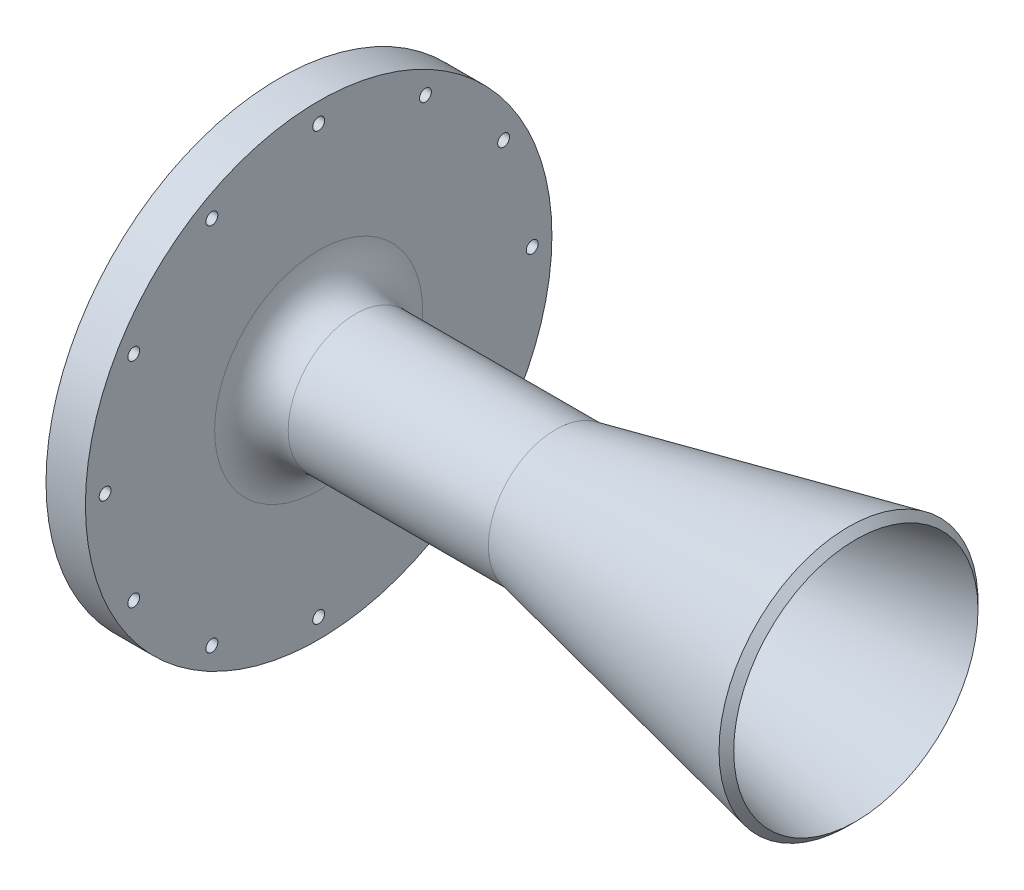
ISO-10303-21;
HEADER;
FILE_DESCRIPTION(('STEP AP214'),'2;1');
FILE_NAME('part.step','',(''),(''),'','','');
FILE_SCHEMA(('AUTOMOTIVE_DESIGN { 1 0 10303 214 1 1 1 1 }'));
ENDSEC;
DATA;
#1=APPLICATION_CONTEXT('core data for automotive mechanical design processes');
#2=APPLICATION_PROTOCOL_DEFINITION('international standard','automotive_design',2000,#1);
#3=PRODUCT_CONTEXT('',#1,'mechanical');
#4=PRODUCT('Part','Part','',(#3));
#5=PRODUCT_RELATED_PRODUCT_CATEGORY('part','',(#4));
#6=PRODUCT_DEFINITION_FORMATION('','',#4);
#7=PRODUCT_DEFINITION_CONTEXT('part definition',#1,'design');
#8=PRODUCT_DEFINITION('design','',#6,#7);
#9=PRODUCT_DEFINITION_SHAPE('','',#8);
#10=(LENGTH_UNIT() NAMED_UNIT(*) SI_UNIT(.MILLI.,.METRE.));
#11=(NAMED_UNIT(*) PLANE_ANGLE_UNIT() SI_UNIT($,.RADIAN.));
#12=(NAMED_UNIT(*) SI_UNIT($,.STERADIAN.) SOLID_ANGLE_UNIT());
#13=UNCERTAINTY_MEASURE_WITH_UNIT(LENGTH_MEASURE(1.E-05),#10,'distance_accuracy_value','');
#14=(GEOMETRIC_REPRESENTATION_CONTEXT(3) GLOBAL_UNCERTAINTY_ASSIGNED_CONTEXT((#13)) GLOBAL_UNIT_ASSIGNED_CONTEXT((#10,
#11,#12)) REPRESENTATION_CONTEXT('',''));
#15=CARTESIAN_POINT('',(0.,0.,0.));
#16=DIRECTION('',(0.,0.,1.));
#17=DIRECTION('',(1.,0.,0.));
#18=AXIS2_PLACEMENT_3D('',#15,#16,#17);
#19=CARTESIAN_POINT('',(0.,20.583496155902,0.));
#20=DIRECTION('',(1.,0.,0.));
#21=DIRECTION('',(0.,0.,-1.));
#22=AXIS2_PLACEMENT_3D('',#19,#20,#21);
#23=PLANE('',#22);
#24=CARTESIAN_POINT('',(0.,0.,0.));
#25=DIRECTION('',(1.,0.,0.));
#26=DIRECTION('',(0.,0.,-1.));
#27=AXIS2_PLACEMENT_3D('',#24,#25,#26);
#28=CIRCLE('',#27,38.1);
#29=CARTESIAN_POINT('',(0.,0.,-38.1));
#30=VERTEX_POINT('',#29);
#31=EDGE_CURVE('E168',#30,#30,#28,.T.);
#32=ORIENTED_EDGE('',*,*,#31,.T.);
#33=EDGE_LOOP('',(#32));
#34=FACE_BOUND('',#33,.T.);
#35=CARTESIAN_POINT('',(0.,-13.3616626129386,49.8664037450867));
#36=DIRECTION('',(-1.,0.,0.));
#37=DIRECTION('',(0.,0.,1.));
#38=AXIS2_PLACEMENT_3D('',#35,#36,#37);
#39=CIRCLE('',#38,2.38125);
#40=CARTESIAN_POINT('',(0.,-13.3616626129386,52.2476537450867));
#41=VERTEX_POINT('',#40);
#42=EDGE_CURVE('E59',#41,#41,#39,.T.);
#43=ORIENTED_EDGE('',*,*,#42,.F.);
#44=EDGE_LOOP('',(#43));
#45=FACE_BOUND('',#44,.T.);
#46=CARTESIAN_POINT('',(0.,13.3616626129382,-49.8664037450868));
#47=DIRECTION('',(-1.,0.,0.));
#48=DIRECTION('',(0.,0.,1.));
#49=AXIS2_PLACEMENT_3D('',#46,#47,#48);
#50=CIRCLE('',#49,2.38125);
#51=CARTESIAN_POINT('',(0.,13.3616626129382,-47.4851537450868));
#52=VERTEX_POINT('',#51);
#53=EDGE_CURVE('E58',#52,#52,#50,.T.);
#54=ORIENTED_EDGE('',*,*,#53,.F.);
#55=EDGE_LOOP('',(#54));
#56=FACE_BOUND('',#55,.T.);
#57=CARTESIAN_POINT('',(0.,-44.7089944830735,-25.81275));
#58=DIRECTION('',(-1.,0.,0.));
#59=DIRECTION('',(0.,0.,1.));
#60=AXIS2_PLACEMENT_3D('',#57,#58,#59);
#61=CIRCLE('',#60,1.43509999999999);
#62=CARTESIAN_POINT('',(0.,-44.7089944830735,-24.37765));
#63=VERTEX_POINT('',#62);
#64=EDGE_CURVE('E77',#63,#63,#61,.T.);
#65=ORIENTED_EDGE('',*,*,#64,.F.);
#66=EDGE_LOOP('',(#65));
#67=FACE_BOUND('',#66,.T.);
#68=CARTESIAN_POINT('',(0.,-25.81275,-44.7089944830735));
#69=DIRECTION('',(-1.,0.,0.));
#70=DIRECTION('',(0.,0.,1.));
#71=AXIS2_PLACEMENT_3D('',#68,#69,#70);
#72=CIRCLE('',#71,1.43509999999999);
#73=CARTESIAN_POINT('',(0.,-25.81275,-43.2738944830735));
#74=VERTEX_POINT('',#73);
#75=EDGE_CURVE('E83',#74,#74,#72,.T.);
#76=ORIENTED_EDGE('',*,*,#75,.F.);
#77=EDGE_LOOP('',(#76));
#78=FACE_BOUND('',#77,.T.);
#79=CARTESIAN_POINT('',(0.,0.,-51.6255));
#80=DIRECTION('',(-1.,0.,0.));
#81=DIRECTION('',(0.,0.,1.));
#82=AXIS2_PLACEMENT_3D('',#79,#80,#81);
#83=CIRCLE('',#82,1.43509999999999);
#84=CARTESIAN_POINT('',(0.,0.,-50.1904));
#85=VERTEX_POINT('',#84);
#86=EDGE_CURVE('E89',#85,#85,#83,.T.);
#87=ORIENTED_EDGE('',*,*,#86,.F.);
#88=EDGE_LOOP('',(#87));
#89=FACE_BOUND('',#88,.T.);
#90=CARTESIAN_POINT('',(0.,25.81275,-44.7089944830735));
#91=DIRECTION('',(-1.,0.,0.));
#92=DIRECTION('',(0.,0.,1.));
#93=AXIS2_PLACEMENT_3D('',#90,#91,#92);
#94=CIRCLE('',#93,1.43509999999999);
#95=CARTESIAN_POINT('',(0.,25.81275,-43.2738944830736));
#96=VERTEX_POINT('',#95);
#97=EDGE_CURVE('E95',#96,#96,#94,.T.);
#98=ORIENTED_EDGE('',*,*,#97,.F.);
#99=EDGE_LOOP('',(#98));
#100=FACE_BOUND('',#99,.T.);
#101=CARTESIAN_POINT('',(0.,44.7089944830735,-25.81275));
#102=DIRECTION('',(-1.,0.,0.));
#103=DIRECTION('',(0.,0.,1.));
#104=AXIS2_PLACEMENT_3D('',#101,#102,#103);
#105=CIRCLE('',#104,1.43509999999999);
#106=CARTESIAN_POINT('',(0.,44.7089944830735,-24.37765));
#107=VERTEX_POINT('',#106);
#108=EDGE_CURVE('E101',#107,#107,#105,.T.);
#109=ORIENTED_EDGE('',*,*,#108,.F.);
#110=EDGE_LOOP('',(#109));
#111=FACE_BOUND('',#110,.T.);
#112=CARTESIAN_POINT('',(0.,51.6255,0.));
#113=DIRECTION('',(-1.,0.,0.));
#114=DIRECTION('',(0.,0.,1.));
#115=AXIS2_PLACEMENT_3D('',#112,#113,#114);
#116=CIRCLE('',#115,1.43509999999999);
#117=CARTESIAN_POINT('',(0.,51.6255,1.43509999999999));
#118=VERTEX_POINT('',#117);
#119=EDGE_CURVE('E107',#118,#118,#116,.T.);
#120=ORIENTED_EDGE('',*,*,#119,.F.);
#121=EDGE_LOOP('',(#120));
#122=FACE_BOUND('',#121,.T.);
#123=CARTESIAN_POINT('',(0.,44.7089944830736,25.81275));
#124=DIRECTION('',(-1.,0.,0.));
#125=DIRECTION('',(0.,0.,1.));
#126=AXIS2_PLACEMENT_3D('',#123,#124,#125);
#127=CIRCLE('',#126,1.43509999999999);
#128=CARTESIAN_POINT('',(0.,44.7089944830736,27.24785));
#129=VERTEX_POINT('',#128);
#130=EDGE_CURVE('E113',#129,#129,#127,.T.);
#131=ORIENTED_EDGE('',*,*,#130,.F.);
#132=EDGE_LOOP('',(#131));
#133=FACE_BOUND('',#132,.T.);
#134=CARTESIAN_POINT('',(0.,25.81275,44.7089944830735));
#135=DIRECTION('',(-1.,0.,0.));
#136=DIRECTION('',(0.,0.,1.));
#137=AXIS2_PLACEMENT_3D('',#134,#135,#136);
#138=CIRCLE('',#137,1.43509999999999);
#139=CARTESIAN_POINT('',(0.,25.81275,46.1440944830735));
#140=VERTEX_POINT('',#139);
#141=EDGE_CURVE('E119',#140,#140,#138,.T.);
#142=ORIENTED_EDGE('',*,*,#141,.F.);
#143=EDGE_LOOP('',(#142));
#144=FACE_BOUND('',#143,.T.);
#145=CARTESIAN_POINT('',(0.,0.,51.6255));
#146=DIRECTION('',(-1.,0.,0.));
#147=DIRECTION('',(0.,0.,1.));
#148=AXIS2_PLACEMENT_3D('',#145,#146,#147);
#149=CIRCLE('',#148,1.43509999999999);
#150=CARTESIAN_POINT('',(0.,0.,53.0606));
#151=VERTEX_POINT('',#150);
#152=EDGE_CURVE('E125',#151,#151,#149,.T.);
#153=ORIENTED_EDGE('',*,*,#152,.F.);
#154=EDGE_LOOP('',(#153));
#155=FACE_BOUND('',#154,.T.);
#156=CARTESIAN_POINT('',(0.,-25.81275,44.7089944830736));
#157=DIRECTION('',(-1.,0.,0.));
#158=DIRECTION('',(0.,0.,1.));
#159=AXIS2_PLACEMENT_3D('',#156,#157,#158);
#160=CIRCLE('',#159,1.43509999999999);
#161=CARTESIAN_POINT('',(0.,-25.81275,46.1440944830736));
#162=VERTEX_POINT('',#161);
#163=EDGE_CURVE('E131',#162,#162,#160,.T.);
#164=ORIENTED_EDGE('',*,*,#163,.F.);
#165=EDGE_LOOP('',(#164));
#166=FACE_BOUND('',#165,.T.);
#167=CARTESIAN_POINT('',(0.,-44.7089944830735,25.81275));
#168=DIRECTION('',(-1.,0.,0.));
#169=DIRECTION('',(0.,0.,1.));
#170=AXIS2_PLACEMENT_3D('',#167,#168,#169);
#171=CIRCLE('',#170,1.43509999999999);
#172=CARTESIAN_POINT('',(0.,-44.7089944830735,27.24785));
#173=VERTEX_POINT('',#172);
#174=EDGE_CURVE('E137',#173,#173,#171,.T.);
#175=ORIENTED_EDGE('',*,*,#174,.F.);
#176=EDGE_LOOP('',(#175));
#177=FACE_BOUND('',#176,.T.);
#178=CARTESIAN_POINT('',(0.,0.,0.));
#179=DIRECTION('',(-1.,0.,0.));
#180=DIRECTION('',(0.,0.,1.));
#181=AXIS2_PLACEMENT_3D('',#178,#179,#180);
#182=CIRCLE('',#181,56.388);
#183=CARTESIAN_POINT('',(0.,0.,56.388));
#184=VERTEX_POINT('',#183);
#185=EDGE_CURVE('E149',#184,#184,#182,.T.);
#186=ORIENTED_EDGE('',*,*,#185,.T.);
#187=EDGE_LOOP('',(#186));
#188=FACE_BOUND('',#187,.T.);
#189=CARTESIAN_POINT('',(0.,-51.6255,0.));
#190=DIRECTION('',(-1.,0.,0.));
#191=DIRECTION('',(0.,0.,1.));
#192=AXIS2_PLACEMENT_3D('',#189,#190,#191);
#193=CIRCLE('',#192,1.43509999999999);
#194=CARTESIAN_POINT('',(0.,-51.6255,1.43509999999999));
#195=VERTEX_POINT('',#194);
#196=EDGE_CURVE('E71',#195,#195,#193,.T.);
#197=ORIENTED_EDGE('',*,*,#196,.F.);
#198=EDGE_LOOP('',(#197));
#199=FACE_BOUND('',#198,.T.);
#200=ADVANCED_FACE('F34',(#34,#45,#56,#67,#78,#89,#100,#111,#122,#133,#144,#155,#166,#177,#188,
#199),#23,.F.);
#201=CARTESIAN_POINT('',(60.325,0.,0.));
#202=DIRECTION('',(1.,0.,0.));
#203=DIRECTION('',(0.,0.,-1.));
#204=AXIS2_PLACEMENT_3D('',#201,#202,#203);
#205=CONICAL_SURFACE('',#204,12.7207818181818,0.20943951023932);
#206=CARTESIAN_POINT('',(139.384584692517,0.,0.));
#207=DIRECTION('',(1.,0.,0.));
#208=DIRECTION('',(0.,0.,-1.));
#209=AXIS2_PLACEMENT_3D('',#206,#207,#208);
#210=CIRCLE('',#209,29.5254153074831);
#211=CARTESIAN_POINT('',(139.384584692517,0.,-29.5254153074831));
#212=VERTEX_POINT('',#211);
#213=EDGE_CURVE('E11',#212,#212,#210,.T.);
#214=ORIENTED_EDGE('',*,*,#213,.T.);
#215=EDGE_LOOP('',(#214));
#216=FACE_BOUND('',#215,.T.);
#217=CARTESIAN_POINT('',(60.325,0.,0.));
#218=DIRECTION('',(-1.,0.,0.));
#219=DIRECTION('',(0.,0.,1.));
#220=AXIS2_PLACEMENT_3D('',#217,#218,#219);
#221=CIRCLE('',#220,12.7207818181818);
#222=CARTESIAN_POINT('',(60.325,0.,12.7207818181818));
#223=VERTEX_POINT('',#222);
#224=EDGE_CURVE('E158',#223,#223,#221,.T.);
#225=ORIENTED_EDGE('',*,*,#224,.T.);
#226=EDGE_LOOP('',(#225));
#227=FACE_BOUND('',#226,.T.);
#228=ADVANCED_FACE('F186',(#216,#227),#205,.F.);
#229=CARTESIAN_POINT('',(60.325,12.7207818181818,0.));
#230=DIRECTION('',(1.,0.,0.));
#231=DIRECTION('',(0.,0.,-1.));
#232=AXIS2_PLACEMENT_3D('',#229,#230,#231);
#233=PLANE('',#232);
#234=ORIENTED_EDGE('',*,*,#224,.F.);
#235=EDGE_LOOP('',(#234));
#236=FACE_BOUND('',#235,.T.);
#237=CARTESIAN_POINT('',(60.325,0.,0.));
#238=DIRECTION('',(-1.,0.,0.));
#239=DIRECTION('',(0.,0.,1.));
#240=AXIS2_PLACEMENT_3D('',#237,#238,#239);
#241=CIRCLE('',#240,14.351);
#242=CARTESIAN_POINT('',(60.325,0.,14.351));
#243=VERTEX_POINT('',#242);
#244=EDGE_CURVE('E155',#243,#243,#241,.T.);
#245=ORIENTED_EDGE('',*,*,#244,.T.);
#246=EDGE_LOOP('',(#245));
#247=FACE_BOUND('',#246,.T.);
#248=ADVANCED_FACE('F192',(#236,#247),#233,.F.);
#249=CARTESIAN_POINT('',(0.,0.,0.));
#250=DIRECTION('',(-1.,0.,0.));
#251=DIRECTION('',(0.,0.,1.));
#252=AXIS2_PLACEMENT_3D('',#249,#250,#251);
#253=CYLINDRICAL_SURFACE('',#252,14.351);
#254=ORIENTED_EDGE('',*,*,#244,.F.);
#255=EDGE_LOOP('',(#254));
#256=FACE_BOUND('',#255,.T.);
#257=CARTESIAN_POINT('',(10.795,0.,0.));
#258=DIRECTION('',(-1.,0.,0.));
#259=DIRECTION('',(0.,0.,1.));
#260=AXIS2_PLACEMENT_3D('',#257,#258,#259);
#261=CIRCLE('',#260,14.351);
#262=CARTESIAN_POINT('',(10.795,0.,14.351));
#263=VERTEX_POINT('',#262);
#264=EDGE_CURVE('E152',#263,#263,#261,.T.);
#265=ORIENTED_EDGE('',*,*,#264,.T.);
#266=EDGE_LOOP('',(#265));
#267=FACE_BOUND('',#266,.T.);
#268=ADVANCED_FACE('F204',(#256,#267),#253,.F.);
#269=CARTESIAN_POINT('',(0.,0.,0.));
#270=DIRECTION('',(-1.,0.,0.));
#271=DIRECTION('',(0.,0.,1.));
#272=AXIS2_PLACEMENT_3D('',#269,#270,#271);
#273=CONICAL_SURFACE('',#272,20.583496155902,0.5235987755983);
#274=CARTESIAN_POINT('',(1.61402236879913,0.,0.));
#275=DIRECTION('',(-1.,0.,0.));
#276=DIRECTION('',(0.,0.,1.));
#277=AXIS2_PLACEMENT_3D('',#274,#275,#276);
#278=CIRCLE('',#277,19.6516399067978);
#279=CARTESIAN_POINT('',(1.61402236879913,0.,19.6516399067978));
#280=VERTEX_POINT('',#279);
#281=EDGE_CURVE('E65',#280,#280,#278,.T.);
#282=ORIENTED_EDGE('',*,*,#281,.T.);
#283=EDGE_LOOP('',(#282));
#284=FACE_BOUND('',#283,.T.);
#285=ORIENTED_EDGE('',*,*,#264,.F.);
#286=EDGE_LOOP('',(#285));
#287=FACE_BOUND('',#286,.T.);
#288=ADVANCED_FACE('F201',(#284,#287),#273,.F.);
#289=CARTESIAN_POINT('',(0.,0.,0.));
#290=DIRECTION('',(-1.,0.,0.));
#291=DIRECTION('',(0.,0.,1.));
#292=AXIS2_PLACEMENT_3D('',#289,#290,#291);
#293=CYLINDRICAL_SURFACE('',#292,56.388);
#294=ORIENTED_EDGE('',*,*,#185,.F.);
#295=EDGE_LOOP('',(#294));
#296=FACE_BOUND('',#295,.T.);
#297=CARTESIAN_POINT('',(9.525,0.,0.));
#298=DIRECTION('',(-1.,0.,0.));
#299=DIRECTION('',(0.,0.,1.));
#300=AXIS2_PLACEMENT_3D('',#297,#298,#299);
#301=CIRCLE('',#300,56.388);
#302=CARTESIAN_POINT('',(9.525,0.,56.388));
#303=VERTEX_POINT('',#302);
#304=EDGE_CURVE('E146',#303,#303,#301,.T.);
#305=ORIENTED_EDGE('',*,*,#304,.T.);
#306=EDGE_LOOP('',(#305));
#307=FACE_BOUND('',#306,.T.);
#308=ADVANCED_FACE('F199',(#296,#307),#293,.T.);
#309=CARTESIAN_POINT('',(9.525,56.388,0.));
#310=DIRECTION('',(-1.,0.,0.));
#311=DIRECTION('',(0.,0.,1.));
#312=AXIS2_PLACEMENT_3D('',#309,#310,#311);
#313=PLANE('',#312);
#314=CARTESIAN_POINT('',(9.525,0.,0.));
#315=DIRECTION('',(-1.,0.,0.));
#316=DIRECTION('',(0.,0.,1.));
#317=AXIS2_PLACEMENT_3D('',#314,#315,#316);
#318=CIRCLE('',#317,25.146);
#319=CARTESIAN_POINT('',(9.525,0.,25.146));
#320=VERTEX_POINT('',#319);
#321=EDGE_CURVE('E161',#320,#320,#318,.T.);
#322=ORIENTED_EDGE('',*,*,#321,.T.);
#323=EDGE_LOOP('',(#322));
#324=FACE_BOUND('',#323,.T.);
#325=CARTESIAN_POINT('',(9.525,-51.6255,0.));
#326=DIRECTION('',(-1.,0.,0.));
#327=DIRECTION('',(0.,0.,1.));
#328=AXIS2_PLACEMENT_3D('',#325,#326,#327);
#329=CIRCLE('',#328,1.43509999999999);
#330=CARTESIAN_POINT('',(9.525,-51.6255,1.43509999999999));
#331=VERTEX_POINT('',#330);
#332=EDGE_CURVE('E74',#331,#331,#329,.T.);
#333=ORIENTED_EDGE('',*,*,#332,.T.);
#334=EDGE_LOOP('',(#333));
#335=FACE_BOUND('',#334,.T.);
#336=CARTESIAN_POINT('',(9.525,-44.7089944830735,-25.81275));
#337=DIRECTION('',(-1.,0.,0.));
#338=DIRECTION('',(0.,0.,1.));
#339=AXIS2_PLACEMENT_3D('',#336,#337,#338);
#340=CIRCLE('',#339,1.43509999999999);
#341=CARTESIAN_POINT('',(9.525,-44.7089944830735,-24.37765));
#342=VERTEX_POINT('',#341);
#343=EDGE_CURVE('E80',#342,#342,#340,.T.);
#344=ORIENTED_EDGE('',*,*,#343,.T.);
#345=EDGE_LOOP('',(#344));
#346=FACE_BOUND('',#345,.T.);
#347=CARTESIAN_POINT('',(9.525,-25.81275,-44.7089944830735));
#348=DIRECTION('',(-1.,0.,0.));
#349=DIRECTION('',(0.,0.,1.));
#350=AXIS2_PLACEMENT_3D('',#347,#348,#349);
#351=CIRCLE('',#350,1.43509999999999);
#352=CARTESIAN_POINT('',(9.525,-25.81275,-43.2738944830735));
#353=VERTEX_POINT('',#352);
#354=EDGE_CURVE('E86',#353,#353,#351,.T.);
#355=ORIENTED_EDGE('',*,*,#354,.T.);
#356=EDGE_LOOP('',(#355));
#357=FACE_BOUND('',#356,.T.);
#358=CARTESIAN_POINT('',(9.525,0.,-51.6255));
#359=DIRECTION('',(-1.,0.,0.));
#360=DIRECTION('',(0.,0.,1.));
#361=AXIS2_PLACEMENT_3D('',#358,#359,#360);
#362=CIRCLE('',#361,1.43509999999999);
#363=CARTESIAN_POINT('',(9.525,0.,-50.1904));
#364=VERTEX_POINT('',#363);
#365=EDGE_CURVE('E92',#364,#364,#362,.T.);
#366=ORIENTED_EDGE('',*,*,#365,.T.);
#367=EDGE_LOOP('',(#366));
#368=FACE_BOUND('',#367,.T.);
#369=CARTESIAN_POINT('',(9.525,25.81275,-44.7089944830735));
#370=DIRECTION('',(-1.,0.,0.));
#371=DIRECTION('',(0.,0.,1.));
#372=AXIS2_PLACEMENT_3D('',#369,#370,#371);
#373=CIRCLE('',#372,1.43509999999999);
#374=CARTESIAN_POINT('',(9.525,25.81275,-43.2738944830736));
#375=VERTEX_POINT('',#374);
#376=EDGE_CURVE('E98',#375,#375,#373,.T.);
#377=ORIENTED_EDGE('',*,*,#376,.T.);
#378=EDGE_LOOP('',(#377));
#379=FACE_BOUND('',#378,.T.);
#380=CARTESIAN_POINT('',(9.525,44.7089944830735,-25.81275));
#381=DIRECTION('',(-1.,0.,0.));
#382=DIRECTION('',(0.,0.,1.));
#383=AXIS2_PLACEMENT_3D('',#380,#381,#382);
#384=CIRCLE('',#383,1.43509999999999);
#385=CARTESIAN_POINT('',(9.525,44.7089944830735,-24.37765));
#386=VERTEX_POINT('',#385);
#387=EDGE_CURVE('E104',#386,#386,#384,.T.);
#388=ORIENTED_EDGE('',*,*,#387,.T.);
#389=EDGE_LOOP('',(#388));
#390=FACE_BOUND('',#389,.T.);
#391=CARTESIAN_POINT('',(9.525,51.6255,0.));
#392=DIRECTION('',(-1.,0.,0.));
#393=DIRECTION('',(0.,0.,1.));
#394=AXIS2_PLACEMENT_3D('',#391,#392,#393);
#395=CIRCLE('',#394,1.43509999999999);
#396=CARTESIAN_POINT('',(9.525,51.6255,1.43509999999999));
#397=VERTEX_POINT('',#396);
#398=EDGE_CURVE('E110',#397,#397,#395,.T.);
#399=ORIENTED_EDGE('',*,*,#398,.T.);
#400=EDGE_LOOP('',(#399));
#401=FACE_BOUND('',#400,.T.);
#402=CARTESIAN_POINT('',(9.525,44.7089944830736,25.81275));
#403=DIRECTION('',(-1.,0.,0.));
#404=DIRECTION('',(0.,0.,1.));
#405=AXIS2_PLACEMENT_3D('',#402,#403,#404);
#406=CIRCLE('',#405,1.43509999999999);
#407=CARTESIAN_POINT('',(9.525,44.7089944830736,27.24785));
#408=VERTEX_POINT('',#407);
#409=EDGE_CURVE('E116',#408,#408,#406,.T.);
#410=ORIENTED_EDGE('',*,*,#409,.T.);
#411=EDGE_LOOP('',(#410));
#412=FACE_BOUND('',#411,.T.);
#413=CARTESIAN_POINT('',(9.525,25.81275,44.7089944830735));
#414=DIRECTION('',(-1.,0.,0.));
#415=DIRECTION('',(0.,0.,1.));
#416=AXIS2_PLACEMENT_3D('',#413,#414,#415);
#417=CIRCLE('',#416,1.43509999999999);
#418=CARTESIAN_POINT('',(9.525,25.81275,46.1440944830735));
#419=VERTEX_POINT('',#418);
#420=EDGE_CURVE('E122',#419,#419,#417,.T.);
#421=ORIENTED_EDGE('',*,*,#420,.T.);
#422=EDGE_LOOP('',(#421));
#423=FACE_BOUND('',#422,.T.);
#424=CARTESIAN_POINT('',(9.525,0.,51.6255));
#425=DIRECTION('',(-1.,0.,0.));
#426=DIRECTION('',(0.,0.,1.));
#427=AXIS2_PLACEMENT_3D('',#424,#425,#426);
#428=CIRCLE('',#427,1.43509999999999);
#429=CARTESIAN_POINT('',(9.525,0.,53.0606));
#430=VERTEX_POINT('',#429);
#431=EDGE_CURVE('E128',#430,#430,#428,.T.);
#432=ORIENTED_EDGE('',*,*,#431,.T.);
#433=EDGE_LOOP('',(#432));
#434=FACE_BOUND('',#433,.T.);
#435=CARTESIAN_POINT('',(9.525,-25.81275,44.7089944830736));
#436=DIRECTION('',(-1.,0.,0.));
#437=DIRECTION('',(0.,0.,1.));
#438=AXIS2_PLACEMENT_3D('',#435,#436,#437);
#439=CIRCLE('',#438,1.43509999999999);
#440=CARTESIAN_POINT('',(9.525,-25.81275,46.1440944830736));
#441=VERTEX_POINT('',#440);
#442=EDGE_CURVE('E134',#441,#441,#439,.T.);
#443=ORIENTED_EDGE('',*,*,#442,.T.);
#444=EDGE_LOOP('',(#443));
#445=FACE_BOUND('',#444,.T.);
#446=CARTESIAN_POINT('',(9.525,-44.7089944830735,25.81275));
#447=DIRECTION('',(-1.,0.,0.));
#448=DIRECTION('',(0.,0.,1.));
#449=AXIS2_PLACEMENT_3D('',#446,#447,#448);
#450=CIRCLE('',#449,1.43509999999999);
#451=CARTESIAN_POINT('',(9.525,-44.7089944830735,27.24785));
#452=VERTEX_POINT('',#451);
#453=EDGE_CURVE('E140',#452,#452,#450,.T.);
#454=ORIENTED_EDGE('',*,*,#453,.T.);
#455=EDGE_LOOP('',(#454));
#456=FACE_BOUND('',#455,.T.);
#457=ORIENTED_EDGE('',*,*,#304,.F.);
#458=EDGE_LOOP('',(#457));
#459=FACE_BOUND('',#458,.T.);
#460=ADVANCED_FACE('F221',(#324,#335,#346,#357,#368,#379,#390,#401,#412,#423,#434,#445,#456,
#459),#313,.F.);
#461=CARTESIAN_POINT('',(0.,0.,0.));
#462=DIRECTION('',(-1.,0.,0.));
#463=DIRECTION('',(0.,0.,1.));
#464=AXIS2_PLACEMENT_3D('',#461,#462,#463);
#465=CYLINDRICAL_SURFACE('',#464,16.256);
#466=CARTESIAN_POINT('',(18.415,0.,0.));
#467=DIRECTION('',(-1.,0.,0.));
#468=DIRECTION('',(0.,0.,1.));
#469=AXIS2_PLACEMENT_3D('',#466,#467,#468);
#470=CIRCLE('',#469,16.256);
#471=CARTESIAN_POINT('',(18.415,0.,16.256));
#472=VERTEX_POINT('',#471);
#473=EDGE_CURVE('E164',#472,#472,#470,.F.);
#474=ORIENTED_EDGE('',*,*,#473,.T.);
#475=EDGE_LOOP('',(#474));
#476=FACE_BOUND('',#475,.T.);
#477=CARTESIAN_POINT('',(66.806461083741,0.,0.));
#478=DIRECTION('',(-1.,0.,0.));
#479=DIRECTION('',(0.,0.,1.));
#480=AXIS2_PLACEMENT_3D('',#477,#478,#479);
#481=CIRCLE('',#480,16.256);
#482=CARTESIAN_POINT('',(66.806461083741,0.,16.256));
#483=VERTEX_POINT('',#482);
#484=EDGE_CURVE('E143',#483,#483,#481,.T.);
#485=ORIENTED_EDGE('',*,*,#484,.T.);
#486=EDGE_LOOP('',(#485));
#487=FACE_BOUND('',#486,.T.);
#488=ADVANCED_FACE('F224',(#476,#487),#465,.T.);
#489=CARTESIAN_POINT('',(139.7,0.,0.));
#490=DIRECTION('',(1.,0.,0.));
#491=DIRECTION('',(0.,0.,-1.));
#492=AXIS2_PLACEMENT_3D('',#489,#490,#491);
#493=CONICAL_SURFACE('',#492,31.75,0.20943951023932);
#494=CARTESIAN_POINT('',(137.605252356639,0.,0.));
#495=DIRECTION('',(-1.,0.,0.));
#496=DIRECTION('',(0.,0.,1.));
#497=AXIS2_PLACEMENT_3D('',#494,#495,#496);
#498=CIRCLE('',#497,31.3047476433608);
#499=CARTESIAN_POINT('',(137.605252356639,0.,31.3047476433608));
#500=VERTEX_POINT('',#499);
#501=EDGE_CURVE('E42',#500,#500,#498,.T.);
#502=ORIENTED_EDGE('',*,*,#501,.T.);
#503=EDGE_LOOP('',(#502));
#504=FACE_BOUND('',#503,.T.);
#505=ORIENTED_EDGE('',*,*,#484,.F.);
#506=EDGE_LOOP('',(#505));
#507=FACE_BOUND('',#506,.T.);
#508=ADVANCED_FACE('F172',(#504,#507),#493,.T.);
#509=CARTESIAN_POINT('',(0.,-44.7089944830735,25.81275));
#510=DIRECTION('',(-1.,0.,0.));
#511=DIRECTION('',(0.,0.,1.));
#512=AXIS2_PLACEMENT_3D('',#509,#510,#511);
#513=CYLINDRICAL_SURFACE('',#512,1.43509999999999);
#514=ORIENTED_EDGE('',*,*,#453,.F.);
#515=EDGE_LOOP('',(#514));
#516=FACE_BOUND('',#515,.T.);
#517=ORIENTED_EDGE('',*,*,#174,.T.);
#518=EDGE_LOOP('',(#517));
#519=FACE_BOUND('',#518,.T.);
#520=ADVANCED_FACE('F310',(#516,#519),#513,.F.);
#521=CARTESIAN_POINT('',(0.,-25.81275,44.7089944830736));
#522=DIRECTION('',(-1.,0.,0.));
#523=DIRECTION('',(0.,0.,1.));
#524=AXIS2_PLACEMENT_3D('',#521,#522,#523);
#525=CYLINDRICAL_SURFACE('',#524,1.43509999999999);
#526=ORIENTED_EDGE('',*,*,#442,.F.);
#527=EDGE_LOOP('',(#526));
#528=FACE_BOUND('',#527,.T.);
#529=ORIENTED_EDGE('',*,*,#163,.T.);
#530=EDGE_LOOP('',(#529));
#531=FACE_BOUND('',#530,.T.);
#532=ADVANCED_FACE('F306',(#528,#531),#525,.F.);
#533=CARTESIAN_POINT('',(0.,0.,51.6255));
#534=DIRECTION('',(-1.,0.,0.));
#535=DIRECTION('',(0.,0.,1.));
#536=AXIS2_PLACEMENT_3D('',#533,#534,#535);
#537=CYLINDRICAL_SURFACE('',#536,1.43509999999999);
#538=ORIENTED_EDGE('',*,*,#431,.F.);
#539=EDGE_LOOP('',(#538));
#540=FACE_BOUND('',#539,.T.);
#541=ORIENTED_EDGE('',*,*,#152,.T.);
#542=EDGE_LOOP('',(#541));
#543=FACE_BOUND('',#542,.T.);
#544=ADVANCED_FACE('F302',(#540,#543),#537,.F.);
#545=CARTESIAN_POINT('',(0.,25.81275,44.7089944830735));
#546=DIRECTION('',(-1.,0.,0.));
#547=DIRECTION('',(0.,0.,1.));
#548=AXIS2_PLACEMENT_3D('',#545,#546,#547);
#549=CYLINDRICAL_SURFACE('',#548,1.43509999999999);
#550=ORIENTED_EDGE('',*,*,#420,.F.);
#551=EDGE_LOOP('',(#550));
#552=FACE_BOUND('',#551,.T.);
#553=ORIENTED_EDGE('',*,*,#141,.T.);
#554=EDGE_LOOP('',(#553));
#555=FACE_BOUND('',#554,.T.);
#556=ADVANCED_FACE('F298',(#552,#555),#549,.F.);
#557=CARTESIAN_POINT('',(0.,44.7089944830736,25.81275));
#558=DIRECTION('',(-1.,0.,0.));
#559=DIRECTION('',(0.,0.,1.));
#560=AXIS2_PLACEMENT_3D('',#557,#558,#559);
#561=CYLINDRICAL_SURFACE('',#560,1.43509999999999);
#562=ORIENTED_EDGE('',*,*,#409,.F.);
#563=EDGE_LOOP('',(#562));
#564=FACE_BOUND('',#563,.T.);
#565=ORIENTED_EDGE('',*,*,#130,.T.);
#566=EDGE_LOOP('',(#565));
#567=FACE_BOUND('',#566,.T.);
#568=ADVANCED_FACE('F294',(#564,#567),#561,.F.);
#569=CARTESIAN_POINT('',(0.,51.6255,0.));
#570=DIRECTION('',(-1.,0.,0.));
#571=DIRECTION('',(0.,0.,1.));
#572=AXIS2_PLACEMENT_3D('',#569,#570,#571);
#573=CYLINDRICAL_SURFACE('',#572,1.43509999999999);
#574=ORIENTED_EDGE('',*,*,#398,.F.);
#575=EDGE_LOOP('',(#574));
#576=FACE_BOUND('',#575,.T.);
#577=ORIENTED_EDGE('',*,*,#119,.T.);
#578=EDGE_LOOP('',(#577));
#579=FACE_BOUND('',#578,.T.);
#580=ADVANCED_FACE('F290',(#576,#579),#573,.F.);
#581=CARTESIAN_POINT('',(0.,44.7089944830735,-25.81275));
#582=DIRECTION('',(-1.,0.,0.));
#583=DIRECTION('',(0.,0.,1.));
#584=AXIS2_PLACEMENT_3D('',#581,#582,#583);
#585=CYLINDRICAL_SURFACE('',#584,1.43509999999999);
#586=ORIENTED_EDGE('',*,*,#387,.F.);
#587=EDGE_LOOP('',(#586));
#588=FACE_BOUND('',#587,.T.);
#589=ORIENTED_EDGE('',*,*,#108,.T.);
#590=EDGE_LOOP('',(#589));
#591=FACE_BOUND('',#590,.T.);
#592=ADVANCED_FACE('F286',(#588,#591),#585,.F.);
#593=CARTESIAN_POINT('',(0.,25.81275,-44.7089944830735));
#594=DIRECTION('',(-1.,0.,0.));
#595=DIRECTION('',(0.,0.,1.));
#596=AXIS2_PLACEMENT_3D('',#593,#594,#595);
#597=CYLINDRICAL_SURFACE('',#596,1.43509999999999);
#598=ORIENTED_EDGE('',*,*,#376,.F.);
#599=EDGE_LOOP('',(#598));
#600=FACE_BOUND('',#599,.T.);
#601=ORIENTED_EDGE('',*,*,#97,.T.);
#602=EDGE_LOOP('',(#601));
#603=FACE_BOUND('',#602,.T.);
#604=ADVANCED_FACE('F282',(#600,#603),#597,.F.);
#605=CARTESIAN_POINT('',(0.,0.,-51.6255));
#606=DIRECTION('',(-1.,0.,0.));
#607=DIRECTION('',(0.,0.,1.));
#608=AXIS2_PLACEMENT_3D('',#605,#606,#607);
#609=CYLINDRICAL_SURFACE('',#608,1.43509999999999);
#610=ORIENTED_EDGE('',*,*,#365,.F.);
#611=EDGE_LOOP('',(#610));
#612=FACE_BOUND('',#611,.T.);
#613=ORIENTED_EDGE('',*,*,#86,.T.);
#614=EDGE_LOOP('',(#613));
#615=FACE_BOUND('',#614,.T.);
#616=ADVANCED_FACE('F278',(#612,#615),#609,.F.);
#617=CARTESIAN_POINT('',(0.,-25.81275,-44.7089944830735));
#618=DIRECTION('',(-1.,0.,0.));
#619=DIRECTION('',(0.,0.,1.));
#620=AXIS2_PLACEMENT_3D('',#617,#618,#619);
#621=CYLINDRICAL_SURFACE('',#620,1.43509999999999);
#622=ORIENTED_EDGE('',*,*,#354,.F.);
#623=EDGE_LOOP('',(#622));
#624=FACE_BOUND('',#623,.T.);
#625=ORIENTED_EDGE('',*,*,#75,.T.);
#626=EDGE_LOOP('',(#625));
#627=FACE_BOUND('',#626,.T.);
#628=ADVANCED_FACE('F271',(#624,#627),#621,.F.);
#629=CARTESIAN_POINT('',(0.,-44.7089944830735,-25.81275));
#630=DIRECTION('',(-1.,0.,0.));
#631=DIRECTION('',(0.,0.,1.));
#632=AXIS2_PLACEMENT_3D('',#629,#630,#631);
#633=CYLINDRICAL_SURFACE('',#632,1.43509999999999);
#634=ORIENTED_EDGE('',*,*,#343,.F.);
#635=EDGE_LOOP('',(#634));
#636=FACE_BOUND('',#635,.T.);
#637=ORIENTED_EDGE('',*,*,#64,.T.);
#638=EDGE_LOOP('',(#637));
#639=FACE_BOUND('',#638,.T.);
#640=ADVANCED_FACE('F263',(#636,#639),#633,.F.);
#641=CARTESIAN_POINT('',(0.,-51.6255,0.));
#642=DIRECTION('',(-1.,0.,0.));
#643=DIRECTION('',(0.,0.,1.));
#644=AXIS2_PLACEMENT_3D('',#641,#642,#643);
#645=CYLINDRICAL_SURFACE('',#644,1.43509999999999);
#646=ORIENTED_EDGE('',*,*,#332,.F.);
#647=EDGE_LOOP('',(#646));
#648=FACE_BOUND('',#647,.T.);
#649=ORIENTED_EDGE('',*,*,#196,.T.);
#650=EDGE_LOOP('',(#649));
#651=FACE_BOUND('',#650,.T.);
#652=ADVANCED_FACE('F260',(#648,#651),#645,.F.);
#653=CARTESIAN_POINT('',(6.35,13.3616626129382,-49.8664037450868));
#654=DIRECTION('',(-1.,0.,0.));
#655=DIRECTION('',(0.,0.,1.));
#656=AXIS2_PLACEMENT_3D('',#653,#654,#655);
#657=CONICAL_SURFACE('',#656,2.38124999999999,1.02974425867665);
#658=CARTESIAN_POINT('',(7.78079934905938,13.3616626129382,-49.8664037450868));
#659=VERTEX_POINT('',#658);
#660=VERTEX_LOOP('',#659);
#661=FACE_BOUND('',#660,.T.);
#662=CARTESIAN_POINT('',(6.35,13.3616626129382,-49.8664037450868));
#663=DIRECTION('',(-1.,0.,0.));
#664=DIRECTION('',(0.,0.,1.));
#665=AXIS2_PLACEMENT_3D('',#662,#663,#664);
#666=CIRCLE('',#665,2.38124999999999);
#667=CARTESIAN_POINT('',(6.35,13.3616626129382,-47.4851537450868));
#668=VERTEX_POINT('',#667);
#669=EDGE_CURVE('E62',#668,#668,#666,.T.);
#670=ORIENTED_EDGE('',*,*,#669,.T.);
#671=EDGE_LOOP('',(#670));
#672=FACE_BOUND('',#671,.T.);
#673=ADVANCED_FACE('F262',(#661,#672),#657,.F.);
#674=CARTESIAN_POINT('',(0.,13.3616626129382,-49.8664037450868));
#675=DIRECTION('',(-1.,0.,0.));
#676=DIRECTION('',(0.,0.,1.));
#677=AXIS2_PLACEMENT_3D('',#674,#675,#676);
#678=CYLINDRICAL_SURFACE('',#677,2.38125);
#679=ORIENTED_EDGE('',*,*,#669,.F.);
#680=EDGE_LOOP('',(#679));
#681=FACE_BOUND('',#680,.T.);
#682=ORIENTED_EDGE('',*,*,#53,.T.);
#683=EDGE_LOOP('',(#682));
#684=FACE_BOUND('',#683,.T.);
#685=ADVANCED_FACE('F52',(#681,#684),#678,.F.);
#686=CARTESIAN_POINT('',(6.35,-13.3616626129386,49.8664037450867));
#687=DIRECTION('',(-1.,0.,0.));
#688=DIRECTION('',(0.,0.,1.));
#689=AXIS2_PLACEMENT_3D('',#686,#687,#688);
#690=CONICAL_SURFACE('',#689,2.38125,1.02974425867665);
#691=CARTESIAN_POINT('',(7.78079934905938,-13.3616626129386,49.8664037450867));
#692=VERTEX_POINT('',#691);
#693=VERTEX_LOOP('',#692);
#694=FACE_BOUND('',#693,.T.);
#695=CARTESIAN_POINT('',(6.35,-13.3616626129386,49.8664037450867));
#696=DIRECTION('',(-1.,0.,0.));
#697=DIRECTION('',(0.,0.,1.));
#698=AXIS2_PLACEMENT_3D('',#695,#696,#697);
#699=CIRCLE('',#698,2.38125);
#700=CARTESIAN_POINT('',(6.35,-13.3616626129386,52.2476537450867));
#701=VERTEX_POINT('',#700);
#702=EDGE_CURVE('E56',#701,#701,#699,.T.);
#703=ORIENTED_EDGE('',*,*,#702,.T.);
#704=EDGE_LOOP('',(#703));
#705=FACE_BOUND('',#704,.T.);
#706=ADVANCED_FACE('F48',(#694,#705),#690,.F.);
#707=CARTESIAN_POINT('',(0.,-13.3616626129386,49.8664037450867));
#708=DIRECTION('',(-1.,0.,0.));
#709=DIRECTION('',(0.,0.,1.));
#710=AXIS2_PLACEMENT_3D('',#707,#708,#709);
#711=CYLINDRICAL_SURFACE('',#710,2.38125);
#712=ORIENTED_EDGE('',*,*,#702,.F.);
#713=EDGE_LOOP('',(#712));
#714=FACE_BOUND('',#713,.T.);
#715=ORIENTED_EDGE('',*,*,#42,.T.);
#716=EDGE_LOOP('',(#715));
#717=FACE_BOUND('',#716,.T.);
#718=ADVANCED_FACE('F51',(#714,#717),#711,.F.);
#719=CARTESIAN_POINT('',(18.415,0.,0.));
#720=DIRECTION('',(-1.,0.,0.));
#721=DIRECTION('',(0.,0.,1.));
#722=AXIS2_PLACEMENT_3D('',#719,#720,#721);
#723=TOROIDAL_SURFACE('',#722,25.146,8.89);
#724=ORIENTED_EDGE('',*,*,#473,.F.);
#725=EDGE_LOOP('',(#724));
#726=FACE_BOUND('',#725,.T.);
#727=ORIENTED_EDGE('',*,*,#321,.F.);
#728=EDGE_LOOP('',(#727));
#729=FACE_BOUND('',#728,.T.);
#730=ADVANCED_FACE('F181',(#726,#729),#723,.F.);
#731=CARTESIAN_POINT('',(3.33331808033745,0.,0.));
#732=DIRECTION('',(-1.,0.,0.));
#733=DIRECTION('',(0.,0.,1.));
#734=AXIS2_PLACEMENT_3D('',#731,#732,#733);
#735=CONICAL_SURFACE('',#734,0.,1.48352986419519);
#736=ORIENTED_EDGE('',*,*,#31,.F.);
#737=EDGE_LOOP('',(#736));
#738=FACE_BOUND('',#737,.T.);
#739=ORIENTED_EDGE('',*,*,#281,.F.);
#740=EDGE_LOOP('',(#739));
#741=FACE_BOUND('',#740,.T.);
#742=ADVANCED_FACE('F176',(#738,#741),#735,.F.);
#743=CARTESIAN_POINT('',(137.605252356639,0.,0.));
#744=DIRECTION('',(-1.,0.,0.));
#745=DIRECTION('',(0.,0.,1.));
#746=AXIS2_PLACEMENT_3D('',#743,#744,#745);
#747=CONICAL_SURFACE('',#746,31.3047476433608,0.78539816339744);
#748=ORIENTED_EDGE('',*,*,#213,.F.);
#749=EDGE_LOOP('',(#748));
#750=FACE_BOUND('',#749,.T.);
#751=ORIENTED_EDGE('',*,*,#501,.F.);
#752=EDGE_LOOP('',(#751));
#753=FACE_BOUND('',#752,.T.);
#754=ADVANCED_FACE('F36',(#750,#753),#747,.T.);
#755=CLOSED_SHELL('',(#200,#228,#248,#268,#288,#308,#460,#488,#508,#520,#532,#544,#556,#568,
#580,#592,#604,#616,#628,#640,#652,#673,#685,#706,#718,#730,#742,#754));
#756=MANIFOLD_SOLID_BREP('B2',#755);
#757=ADVANCED_BREP_SHAPE_REPRESENTATION('',(#18,#756),#14);
#758=SHAPE_DEFINITION_REPRESENTATION(#9,#757);
ENDSEC;
END-ISO-10303-21;
